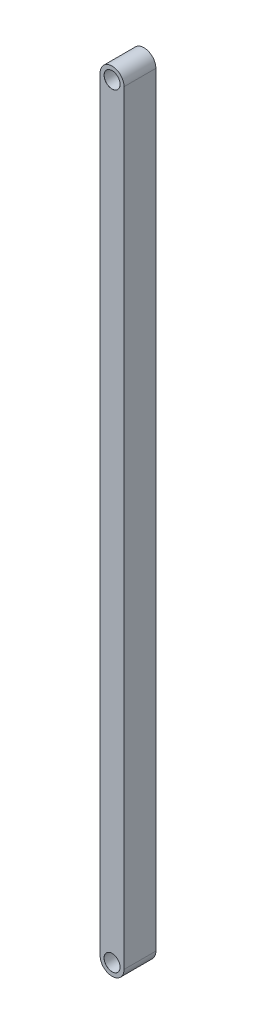
ISO-10303-21;
HEADER;
FILE_DESCRIPTION(('STEP AP214'),'2;1');
FILE_NAME('part.step','',(''),(''),'','','');
FILE_SCHEMA(('AUTOMOTIVE_DESIGN { 1 0 10303 214 1 1 1 1 }'));
ENDSEC;
DATA;
#1=APPLICATION_CONTEXT('core data for automotive mechanical design processes');
#2=APPLICATION_PROTOCOL_DEFINITION('international standard','automotive_design',2000,#1);
#3=PRODUCT_CONTEXT('',#1,'mechanical');
#4=PRODUCT('Part','Part','',(#3));
#5=PRODUCT_RELATED_PRODUCT_CATEGORY('part','',(#4));
#6=PRODUCT_DEFINITION_FORMATION('','',#4);
#7=PRODUCT_DEFINITION_CONTEXT('part definition',#1,'design');
#8=PRODUCT_DEFINITION('design','',#6,#7);
#9=PRODUCT_DEFINITION_SHAPE('','',#8);
#10=(LENGTH_UNIT() NAMED_UNIT(*) SI_UNIT(.MILLI.,.METRE.));
#11=(NAMED_UNIT(*) PLANE_ANGLE_UNIT() SI_UNIT($,.RADIAN.));
#12=(NAMED_UNIT(*) SI_UNIT($,.STERADIAN.) SOLID_ANGLE_UNIT());
#13=UNCERTAINTY_MEASURE_WITH_UNIT(LENGTH_MEASURE(1.E-05),#10,'distance_accuracy_value','');
#14=(GEOMETRIC_REPRESENTATION_CONTEXT(3) GLOBAL_UNCERTAINTY_ASSIGNED_CONTEXT((#13)) GLOBAL_UNIT_ASSIGNED_CONTEXT((#10,
#11,#12)) REPRESENTATION_CONTEXT('',''));
#15=CARTESIAN_POINT('',(0.,0.,0.));
#16=DIRECTION('',(0.,0.,1.));
#17=DIRECTION('',(1.,0.,0.));
#18=AXIS2_PLACEMENT_3D('',#15,#16,#17);
#19=CARTESIAN_POINT('',(-7.49999999999994,-240.,20.));
#20=DIRECTION('',(0.,0.,-1.));
#21=DIRECTION('',(-1.,0.,0.));
#22=AXIS2_PLACEMENT_3D('',#19,#20,#21);
#23=CYLINDRICAL_SURFACE('',#22,7.49999999999997);
#24=CARTESIAN_POINT('',(-7.49999999999994,-240.,0.));
#25=DIRECTION('',(0.,0.,1.));
#26=DIRECTION('',(-1.,0.,0.));
#27=AXIS2_PLACEMENT_3D('',#24,#25,#26);
#28=CIRCLE('',#27,7.49999999999997);
#29=CARTESIAN_POINT('',(-14.9999999999999,-240.,0.));
#30=VERTEX_POINT('',#29);
#31=CARTESIAN_POINT('',(0.,-240.,0.));
#32=VERTEX_POINT('',#31);
#33=EDGE_CURVE('E96',#30,#32,#28,.T.);
#34=ORIENTED_EDGE('',*,*,#33,.T.);
#35=DIRECTION('',(0.,0.,-1.));
#36=VECTOR('',#35,1.);
#37=CARTESIAN_POINT('',(0.,-240.,20.));
#38=LINE('',#37,#36);
#39=CARTESIAN_POINT('',(0.,-240.,20.));
#40=VERTEX_POINT('',#39);
#41=EDGE_CURVE('E11',#40,#32,#38,.T.);
#42=ORIENTED_EDGE('',*,*,#41,.F.);
#43=CARTESIAN_POINT('',(-7.49999999999994,-240.,20.));
#44=DIRECTION('',(0.,0.,1.));
#45=DIRECTION('',(-1.,0.,0.));
#46=AXIS2_PLACEMENT_3D('',#43,#44,#45);
#47=CIRCLE('',#46,7.49999999999997);
#48=CARTESIAN_POINT('',(-14.9999999999999,-240.,20.));
#49=VERTEX_POINT('',#48);
#50=EDGE_CURVE('E84',#49,#40,#47,.T.);
#51=ORIENTED_EDGE('',*,*,#50,.F.);
#52=DIRECTION('',(0.,0.,-1.));
#53=VECTOR('',#52,1.);
#54=CARTESIAN_POINT('',(-14.9999999999999,-240.,20.));
#55=LINE('',#54,#53);
#56=EDGE_CURVE('E92',#49,#30,#55,.T.);
#57=ORIENTED_EDGE('',*,*,#56,.T.);
#58=EDGE_LOOP('',(#34,#42,#51,#57));
#59=FACE_BOUND('',#58,.T.);
#60=ADVANCED_FACE('F33',(#59),#23,.T.);
#61=CARTESIAN_POINT('',(0.,240.,20.));
#62=DIRECTION('',(-1.,0.,0.));
#63=DIRECTION('',(0.,-1.,0.));
#64=AXIS2_PLACEMENT_3D('',#61,#62,#63);
#65=PLANE('',#64);
#66=DIRECTION('',(0.,1.,0.));
#67=VECTOR('',#66,1.);
#68=CARTESIAN_POINT('',(0.,240.,0.));
#69=LINE('',#68,#67);
#70=CARTESIAN_POINT('',(0.,240.,0.));
#71=VERTEX_POINT('',#70);
#72=EDGE_CURVE('E88',#32,#71,#69,.T.);
#73=ORIENTED_EDGE('',*,*,#72,.T.);
#74=DIRECTION('',(0.,0.,-1.));
#75=VECTOR('',#74,1.);
#76=CARTESIAN_POINT('',(0.,240.,20.));
#77=LINE('',#76,#75);
#78=CARTESIAN_POINT('',(0.,240.,20.));
#79=VERTEX_POINT('',#78);
#80=EDGE_CURVE('E41',#79,#71,#77,.T.);
#81=ORIENTED_EDGE('',*,*,#80,.F.);
#82=DIRECTION('',(0.,1.,0.));
#83=VECTOR('',#82,1.);
#84=CARTESIAN_POINT('',(0.,240.,20.));
#85=LINE('',#84,#83);
#86=EDGE_CURVE('E79',#40,#79,#85,.T.);
#87=ORIENTED_EDGE('',*,*,#86,.F.);
#88=ORIENTED_EDGE('',*,*,#41,.T.);
#89=EDGE_LOOP('',(#73,#81,#87,#88));
#90=FACE_BOUND('',#89,.T.);
#91=ADVANCED_FACE('F87',(#90),#65,.F.);
#92=CARTESIAN_POINT('',(-7.50000000000003,240.,20.));
#93=DIRECTION('',(0.,0.,-1.));
#94=DIRECTION('',(-1.,0.,0.));
#95=AXIS2_PLACEMENT_3D('',#92,#93,#94);
#96=CYLINDRICAL_SURFACE('',#95,7.49999999999996);
#97=CARTESIAN_POINT('',(-7.50000000000003,240.,0.));
#98=DIRECTION('',(0.,0.,1.));
#99=DIRECTION('',(-1.,0.,0.));
#100=AXIS2_PLACEMENT_3D('',#97,#98,#99);
#101=CIRCLE('',#100,7.49999999999996);
#102=CARTESIAN_POINT('',(-14.9999999999999,240.,0.));
#103=VERTEX_POINT('',#102);
#104=EDGE_CURVE('E66',#71,#103,#101,.T.);
#105=ORIENTED_EDGE('',*,*,#104,.T.);
#106=DIRECTION('',(0.,0.,-1.));
#107=VECTOR('',#106,1.);
#108=CARTESIAN_POINT('',(-14.9999999999999,240.,20.));
#109=LINE('',#108,#107);
#110=CARTESIAN_POINT('',(-14.9999999999999,240.,20.));
#111=VERTEX_POINT('',#110);
#112=EDGE_CURVE('E89',#111,#103,#109,.T.);
#113=ORIENTED_EDGE('',*,*,#112,.F.);
#114=CARTESIAN_POINT('',(-7.50000000000003,240.,20.));
#115=DIRECTION('',(0.,0.,1.));
#116=DIRECTION('',(-1.,0.,0.));
#117=AXIS2_PLACEMENT_3D('',#114,#115,#116);
#118=CIRCLE('',#117,7.49999999999996);
#119=EDGE_CURVE('E82',#79,#111,#118,.T.);
#120=ORIENTED_EDGE('',*,*,#119,.F.);
#121=ORIENTED_EDGE('',*,*,#80,.T.);
#122=EDGE_LOOP('',(#105,#113,#120,#121));
#123=FACE_BOUND('',#122,.T.);
#124=ADVANCED_FACE('F90',(#123),#96,.T.);
#125=CARTESIAN_POINT('',(-14.9999999999999,-240.,20.));
#126=DIRECTION('',(1.,0.,0.));
#127=DIRECTION('',(0.,1.,0.));
#128=AXIS2_PLACEMENT_3D('',#125,#126,#127);
#129=PLANE('',#128);
#130=DIRECTION('',(0.,-1.,0.));
#131=VECTOR('',#130,1.);
#132=CARTESIAN_POINT('',(-14.9999999999999,-240.,0.));
#133=LINE('',#132,#131);
#134=EDGE_CURVE('E72',#103,#30,#133,.T.);
#135=ORIENTED_EDGE('',*,*,#134,.T.);
#136=ORIENTED_EDGE('',*,*,#56,.F.);
#137=DIRECTION('',(0.,-1.,0.));
#138=VECTOR('',#137,1.);
#139=CARTESIAN_POINT('',(-14.9999999999999,-240.,20.));
#140=LINE('',#139,#138);
#141=EDGE_CURVE('E49',#111,#49,#140,.T.);
#142=ORIENTED_EDGE('',*,*,#141,.F.);
#143=ORIENTED_EDGE('',*,*,#112,.T.);
#144=EDGE_LOOP('',(#135,#136,#142,#143));
#145=FACE_BOUND('',#144,.T.);
#146=ADVANCED_FACE('F104',(#145),#129,.F.);
#147=CARTESIAN_POINT('',(-7.49999999999994,-240.,20.));
#148=DIRECTION('',(0.,0.,-1.));
#149=DIRECTION('',(-1.,0.,0.));
#150=AXIS2_PLACEMENT_3D('',#147,#148,#149);
#151=PLANE('',#150);
#152=CARTESIAN_POINT('',(-7.50000000000003,240.,20.));
#153=DIRECTION('',(0.,0.,1.));
#154=DIRECTION('',(1.,0.,0.));
#155=AXIS2_PLACEMENT_3D('',#152,#153,#154);
#156=CIRCLE('',#155,5.025);
#157=CARTESIAN_POINT('',(-2.47500000000003,240.,20.));
#158=VERTEX_POINT('',#157);
#159=EDGE_CURVE('E124',#158,#158,#156,.T.);
#160=ORIENTED_EDGE('',*,*,#159,.F.);
#161=EDGE_LOOP('',(#160));
#162=FACE_BOUND('',#161,.T.);
#163=CARTESIAN_POINT('',(-7.49999999999994,-240.,20.));
#164=DIRECTION('',(0.,0.,1.));
#165=DIRECTION('',(1.,0.,0.));
#166=AXIS2_PLACEMENT_3D('',#163,#164,#165);
#167=CIRCLE('',#166,5.025);
#168=CARTESIAN_POINT('',(-2.47499999999994,-240.,20.));
#169=VERTEX_POINT('',#168);
#170=EDGE_CURVE('E115',#169,#169,#167,.T.);
#171=ORIENTED_EDGE('',*,*,#170,.F.);
#172=EDGE_LOOP('',(#171));
#173=FACE_BOUND('',#172,.T.);
#174=ORIENTED_EDGE('',*,*,#50,.T.);
#175=ORIENTED_EDGE('',*,*,#86,.T.);
#176=ORIENTED_EDGE('',*,*,#119,.T.);
#177=ORIENTED_EDGE('',*,*,#141,.T.);
#178=EDGE_LOOP('',(#174,#175,#176,#177));
#179=FACE_BOUND('',#178,.T.);
#180=ADVANCED_FACE('F80',(#162,#173,#179),#151,.F.);
#181=CARTESIAN_POINT('',(-7.49999999999994,-240.,0.));
#182=DIRECTION('',(0.,0.,-1.));
#183=DIRECTION('',(-1.,0.,0.));
#184=AXIS2_PLACEMENT_3D('',#181,#182,#183);
#185=PLANE('',#184);
#186=CARTESIAN_POINT('',(-7.50000000000003,240.,0.));
#187=DIRECTION('',(0.,0.,1.));
#188=DIRECTION('',(1.,0.,0.));
#189=AXIS2_PLACEMENT_3D('',#186,#187,#188);
#190=CIRCLE('',#189,4.99999999999987);
#191=CARTESIAN_POINT('',(-2.50000000000015,240.,0.));
#192=VERTEX_POINT('',#191);
#193=EDGE_CURVE('E118',#192,#192,#190,.T.);
#194=ORIENTED_EDGE('',*,*,#193,.T.);
#195=EDGE_LOOP('',(#194));
#196=FACE_BOUND('',#195,.T.);
#197=CARTESIAN_POINT('',(-7.49999999999994,-240.,0.));
#198=DIRECTION('',(0.,0.,1.));
#199=DIRECTION('',(1.,0.,0.));
#200=AXIS2_PLACEMENT_3D('',#197,#198,#199);
#201=CIRCLE('',#200,4.99999999999987);
#202=CARTESIAN_POINT('',(-2.50000000000007,-240.,0.));
#203=VERTEX_POINT('',#202);
#204=EDGE_CURVE('E99',#203,#203,#201,.T.);
#205=ORIENTED_EDGE('',*,*,#204,.T.);
#206=EDGE_LOOP('',(#205));
#207=FACE_BOUND('',#206,.T.);
#208=ORIENTED_EDGE('',*,*,#33,.F.);
#209=ORIENTED_EDGE('',*,*,#134,.F.);
#210=ORIENTED_EDGE('',*,*,#104,.F.);
#211=ORIENTED_EDGE('',*,*,#72,.F.);
#212=EDGE_LOOP('',(#208,#209,#210,#211));
#213=FACE_BOUND('',#212,.T.);
#214=ADVANCED_FACE('F107',(#196,#207,#213),#185,.T.);
#215=CARTESIAN_POINT('',(-7.49999999999994,-240.,20.));
#216=DIRECTION('',(0.,0.,1.));
#217=DIRECTION('',(1.,0.,0.));
#218=AXIS2_PLACEMENT_3D('',#215,#216,#217);
#219=CYLINDRICAL_SURFACE('',#218,4.99999999999993);
#220=ORIENTED_EDGE('',*,*,#204,.F.);
#221=EDGE_LOOP('',(#220));
#222=FACE_BOUND('',#221,.T.);
#223=CARTESIAN_POINT('',(-7.49999999999994,-240.,19.975));
#224=DIRECTION('',(0.,0.,1.));
#225=DIRECTION('',(1.,0.,0.));
#226=AXIS2_PLACEMENT_3D('',#223,#224,#225);
#227=CIRCLE('',#226,4.99999999999999);
#228=CARTESIAN_POINT('',(-2.49999999999995,-240.,19.975));
#229=VERTEX_POINT('',#228);
#230=EDGE_CURVE('E112',#229,#229,#227,.T.);
#231=ORIENTED_EDGE('',*,*,#230,.T.);
#232=EDGE_LOOP('',(#231));
#233=FACE_BOUND('',#232,.T.);
#234=ADVANCED_FACE('F138',(#222,#233),#219,.F.);
#235=CARTESIAN_POINT('',(-7.49999999999994,-240.,20.));
#236=DIRECTION('',(0.,0.,1.));
#237=DIRECTION('',(1.,0.,0.));
#238=AXIS2_PLACEMENT_3D('',#235,#236,#237);
#239=CONICAL_SURFACE('',#238,5.025,0.785398163397709);
#240=ORIENTED_EDGE('',*,*,#230,.F.);
#241=EDGE_LOOP('',(#240));
#242=FACE_BOUND('',#241,.T.);
#243=ORIENTED_EDGE('',*,*,#170,.T.);
#244=EDGE_LOOP('',(#243));
#245=FACE_BOUND('',#244,.T.);
#246=ADVANCED_FACE('F135',(#242,#245),#239,.F.);
#247=CARTESIAN_POINT('',(-7.50000000000003,240.,20.));
#248=DIRECTION('',(0.,0.,1.));
#249=DIRECTION('',(1.,0.,0.));
#250=AXIS2_PLACEMENT_3D('',#247,#248,#249);
#251=CYLINDRICAL_SURFACE('',#250,4.99999999999993);
#252=ORIENTED_EDGE('',*,*,#193,.F.);
#253=EDGE_LOOP('',(#252));
#254=FACE_BOUND('',#253,.T.);
#255=CARTESIAN_POINT('',(-7.50000000000003,240.,19.975));
#256=DIRECTION('',(0.,0.,1.));
#257=DIRECTION('',(1.,0.,0.));
#258=AXIS2_PLACEMENT_3D('',#255,#256,#257);
#259=CIRCLE('',#258,4.99999999999999);
#260=CARTESIAN_POINT('',(-2.50000000000004,240.,19.975));
#261=VERTEX_POINT('',#260);
#262=EDGE_CURVE('E121',#261,#261,#259,.T.);
#263=ORIENTED_EDGE('',*,*,#262,.T.);
#264=EDGE_LOOP('',(#263));
#265=FACE_BOUND('',#264,.T.);
#266=ADVANCED_FACE('F137',(#254,#265),#251,.F.);
#267=CARTESIAN_POINT('',(-7.50000000000003,240.,20.));
#268=DIRECTION('',(0.,0.,1.));
#269=DIRECTION('',(1.,0.,0.));
#270=AXIS2_PLACEMENT_3D('',#267,#268,#269);
#271=CONICAL_SURFACE('',#270,5.025,0.785398163397709);
#272=ORIENTED_EDGE('',*,*,#262,.F.);
#273=EDGE_LOOP('',(#272));
#274=FACE_BOUND('',#273,.T.);
#275=ORIENTED_EDGE('',*,*,#159,.T.);
#276=EDGE_LOOP('',(#275));
#277=FACE_BOUND('',#276,.T.);
#278=ADVANCED_FACE('F128',(#274,#277),#271,.F.);
#279=CLOSED_SHELL('',(#60,#91,#124,#146,#180,#214,#234,#246,#266,#278));
#280=MANIFOLD_SOLID_BREP('B2',#279);
#281=ADVANCED_BREP_SHAPE_REPRESENTATION('',(#18,#280),#14);
#282=SHAPE_DEFINITION_REPRESENTATION(#9,#281);
ENDSEC;
END-ISO-10303-21;
